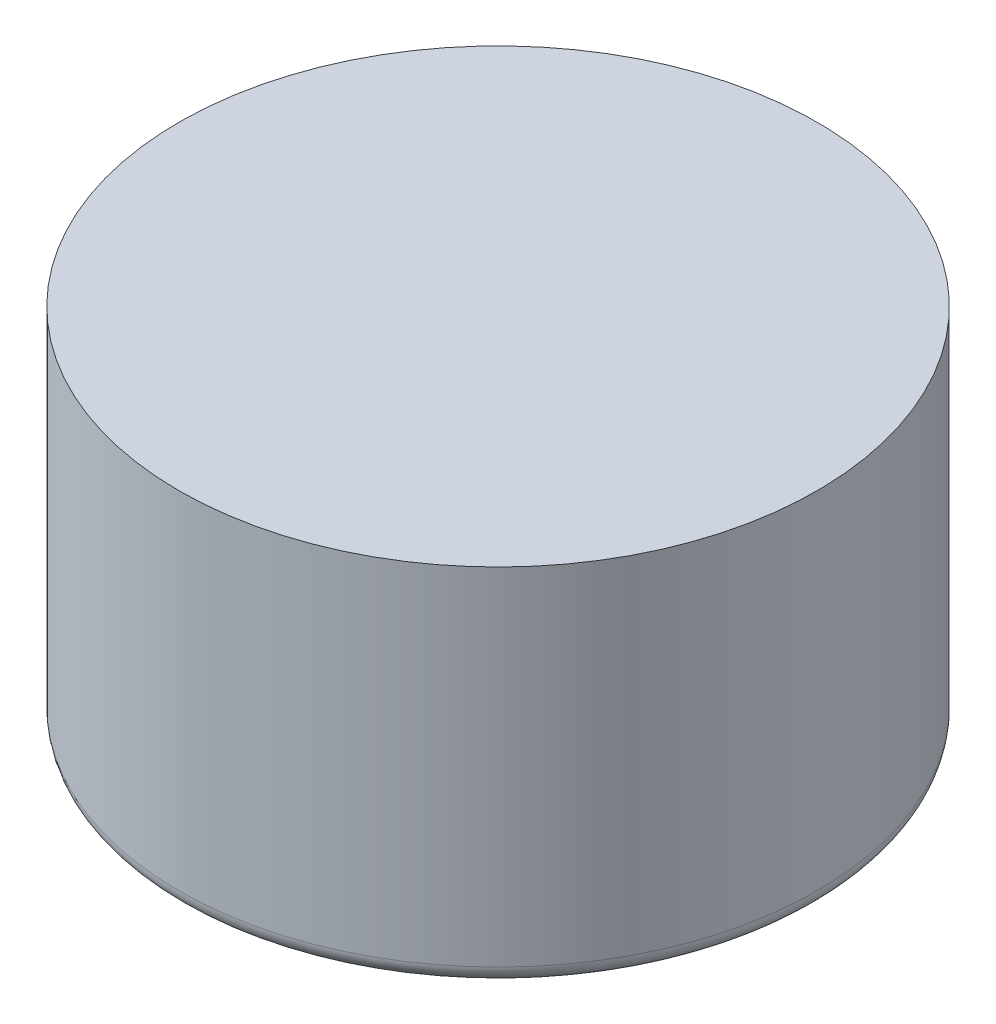
ISO-10303-21;
HEADER;
FILE_DESCRIPTION(('STEP AP214'),'2;1');
FILE_NAME('part.step','',(''),(''),'','','');
FILE_SCHEMA(('AUTOMOTIVE_DESIGN { 1 0 10303 214 1 1 1 1 }'));
ENDSEC;
DATA;
#1=APPLICATION_CONTEXT('core data for automotive mechanical design processes');
#2=APPLICATION_PROTOCOL_DEFINITION('international standard','automotive_design',2000,#1);
#3=PRODUCT_CONTEXT('',#1,'mechanical');
#4=PRODUCT('Part','Part','',(#3));
#5=PRODUCT_RELATED_PRODUCT_CATEGORY('part','',(#4));
#6=PRODUCT_DEFINITION_FORMATION('','',#4);
#7=PRODUCT_DEFINITION_CONTEXT('part definition',#1,'design');
#8=PRODUCT_DEFINITION('design','',#6,#7);
#9=PRODUCT_DEFINITION_SHAPE('','',#8);
#10=(LENGTH_UNIT() NAMED_UNIT(*) SI_UNIT(.MILLI.,.METRE.));
#11=(NAMED_UNIT(*) PLANE_ANGLE_UNIT() SI_UNIT($,.RADIAN.));
#12=(NAMED_UNIT(*) SI_UNIT($,.STERADIAN.) SOLID_ANGLE_UNIT());
#13=UNCERTAINTY_MEASURE_WITH_UNIT(LENGTH_MEASURE(1.E-05),#10,'distance_accuracy_value','');
#14=(GEOMETRIC_REPRESENTATION_CONTEXT(3) GLOBAL_UNCERTAINTY_ASSIGNED_CONTEXT((#13)) GLOBAL_UNIT_ASSIGNED_CONTEXT((#10,
#11,#12)) REPRESENTATION_CONTEXT('',''));
#15=CARTESIAN_POINT('',(0.,0.,0.));
#16=DIRECTION('',(0.,0.,1.));
#17=DIRECTION('',(1.,0.,0.));
#18=AXIS2_PLACEMENT_3D('',#15,#16,#17);
#19=CARTESIAN_POINT('',(0.,2.,0.));
#20=DIRECTION('',(0.,-1.,0.));
#21=DIRECTION('',(0.,0.,-1.));
#22=AXIS2_PLACEMENT_3D('',#19,#20,#21);
#23=CYLINDRICAL_SURFACE('',#22,1.75);
#24=CARTESIAN_POINT('',(0.,0.1,0.));
#25=DIRECTION('',(0.,1.,0.));
#26=DIRECTION('',(0.,0.,1.));
#27=AXIS2_PLACEMENT_3D('',#24,#25,#26);
#28=CIRCLE('',#27,1.75);
#29=CARTESIAN_POINT('',(0.,0.1,1.75));
#30=VERTEX_POINT('',#29);
#31=EDGE_CURVE('E35',#30,#30,#28,.T.);
#32=ORIENTED_EDGE('',*,*,#31,.T.);
#33=EDGE_LOOP('',(#32));
#34=FACE_BOUND('',#33,.T.);
#35=CARTESIAN_POINT('',(0.,2.,0.));
#36=DIRECTION('',(0.,1.,0.));
#37=DIRECTION('',(0.,0.,1.));
#38=AXIS2_PLACEMENT_3D('',#35,#36,#37);
#39=CIRCLE('',#38,1.75);
#40=CARTESIAN_POINT('',(0.,2.,1.75));
#41=VERTEX_POINT('',#40);
#42=EDGE_CURVE('E39',#41,#41,#39,.T.);
#43=ORIENTED_EDGE('',*,*,#42,.F.);
#44=EDGE_LOOP('',(#43));
#45=FACE_BOUND('',#44,.T.);
#46=ADVANCED_FACE('F28',(#34,#45),#23,.T.);
#47=CARTESIAN_POINT('',(0.,2.,0.));
#48=DIRECTION('',(0.,1.,0.));
#49=DIRECTION('',(0.,0.,1.));
#50=AXIS2_PLACEMENT_3D('',#47,#48,#49);
#51=PLANE('',#50);
#52=ORIENTED_EDGE('',*,*,#42,.T.);
#53=EDGE_LOOP('',(#52));
#54=FACE_BOUND('',#53,.T.);
#55=ADVANCED_FACE('F46',(#54),#51,.T.);
#56=CARTESIAN_POINT('',(0.,0.,0.));
#57=DIRECTION('',(0.,1.,0.));
#58=DIRECTION('',(0.,0.,1.));
#59=AXIS2_PLACEMENT_3D('',#56,#57,#58);
#60=PLANE('',#59);
#61=CARTESIAN_POINT('',(0.,0.,0.));
#62=DIRECTION('',(0.,1.,0.));
#63=DIRECTION('',(0.,0.,1.));
#64=AXIS2_PLACEMENT_3D('',#61,#62,#63);
#65=CIRCLE('',#64,1.65);
#66=CARTESIAN_POINT('',(0.,0.,1.65));
#67=VERTEX_POINT('',#66);
#68=EDGE_CURVE('E10',#67,#67,#65,.F.);
#69=ORIENTED_EDGE('',*,*,#68,.T.);
#70=EDGE_LOOP('',(#69));
#71=FACE_BOUND('',#70,.T.);
#72=ADVANCED_FACE('F52',(#71),#60,.F.);
#73=CARTESIAN_POINT('',(0.,0.1,0.));
#74=DIRECTION('',(0.,1.,0.));
#75=DIRECTION('',(0.,0.,1.));
#76=AXIS2_PLACEMENT_3D('',#73,#74,#75);
#77=TOROIDAL_SURFACE('',#76,1.65,0.1);
#78=ORIENTED_EDGE('',*,*,#68,.F.);
#79=EDGE_LOOP('',(#78));
#80=FACE_BOUND('',#79,.T.);
#81=ORIENTED_EDGE('',*,*,#31,.F.);
#82=EDGE_LOOP('',(#81));
#83=FACE_BOUND('',#82,.T.);
#84=ADVANCED_FACE('F30',(#80,#83),#77,.T.);
#85=CLOSED_SHELL('',(#46,#55,#72,#84));
#86=MANIFOLD_SOLID_BREP('B2',#85);
#87=ADVANCED_BREP_SHAPE_REPRESENTATION('',(#18,#86),#14);
#88=SHAPE_DEFINITION_REPRESENTATION(#9,#87);
ENDSEC;
END-ISO-10303-21;
